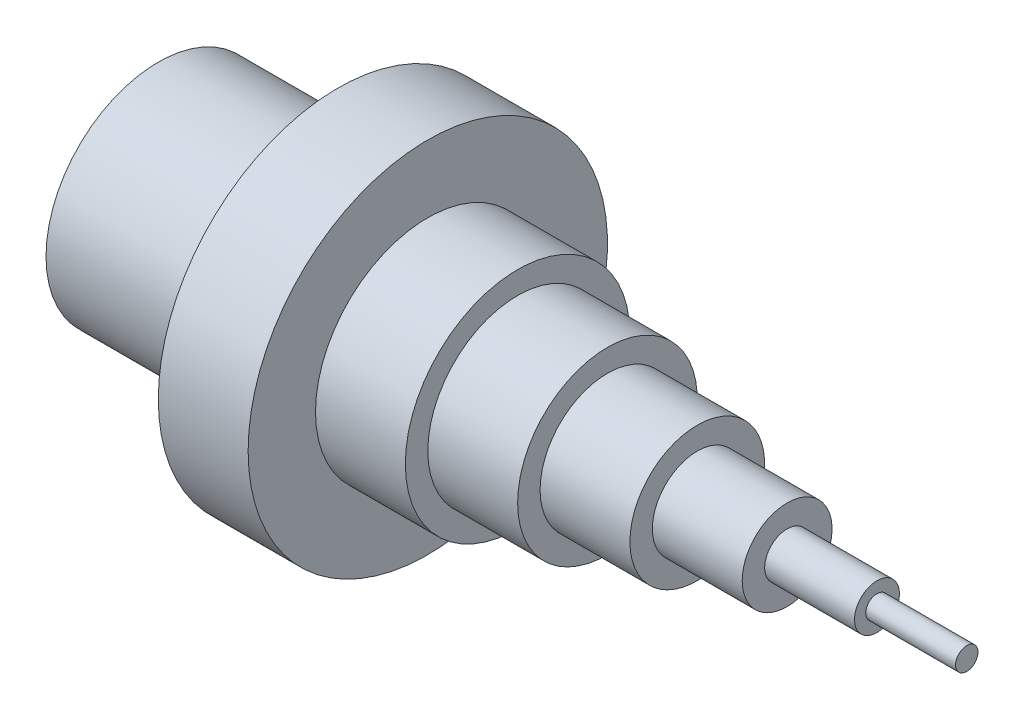
ISO-10303-21;
HEADER;
FILE_DESCRIPTION(('STEP AP214'),'2;1');
FILE_NAME('part.step','',(''),(''),'','','');
FILE_SCHEMA(('AUTOMOTIVE_DESIGN { 1 0 10303 214 1 1 1 1 }'));
ENDSEC;
DATA;
#1=APPLICATION_CONTEXT('core data for automotive mechanical design processes');
#2=APPLICATION_PROTOCOL_DEFINITION('international standard','automotive_design',2000,#1);
#3=PRODUCT_CONTEXT('',#1,'mechanical');
#4=PRODUCT('Part','Part','',(#3));
#5=PRODUCT_RELATED_PRODUCT_CATEGORY('part','',(#4));
#6=PRODUCT_DEFINITION_FORMATION('','',#4);
#7=PRODUCT_DEFINITION_CONTEXT('part definition',#1,'design');
#8=PRODUCT_DEFINITION('design','',#6,#7);
#9=PRODUCT_DEFINITION_SHAPE('','',#8);
#10=(LENGTH_UNIT() NAMED_UNIT(*) SI_UNIT(.MILLI.,.METRE.));
#11=(NAMED_UNIT(*) PLANE_ANGLE_UNIT() SI_UNIT($,.RADIAN.));
#12=(NAMED_UNIT(*) SI_UNIT($,.STERADIAN.) SOLID_ANGLE_UNIT());
#13=UNCERTAINTY_MEASURE_WITH_UNIT(LENGTH_MEASURE(1.E-05),#10,'distance_accuracy_value','');
#14=(GEOMETRIC_REPRESENTATION_CONTEXT(3) GLOBAL_UNCERTAINTY_ASSIGNED_CONTEXT((#13)) GLOBAL_UNIT_ASSIGNED_CONTEXT((#10,
#11,#12)) REPRESENTATION_CONTEXT('',''));
#15=CARTESIAN_POINT('',(0.,0.,0.));
#16=DIRECTION('',(0.,0.,1.));
#17=DIRECTION('',(1.,0.,0.));
#18=AXIS2_PLACEMENT_3D('',#15,#16,#17);
#19=CARTESIAN_POINT('',(0.,0.,0.));
#20=DIRECTION('',(1.,0.,0.));
#21=DIRECTION('',(0.,0.,-1.));
#22=AXIS2_PLACEMENT_3D('',#19,#20,#21);
#23=PLANE('',#22);
#24=CARTESIAN_POINT('',(0.,0.,0.));
#25=DIRECTION('',(-1.,0.,0.));
#26=DIRECTION('',(0.,0.,1.));
#27=AXIS2_PLACEMENT_3D('',#24,#25,#26);
#28=CIRCLE('',#27,20.);
#29=CARTESIAN_POINT('',(0.,0.,20.));
#30=VERTEX_POINT('',#29);
#31=EDGE_CURVE('E87',#30,#30,#28,.T.);
#32=ORIENTED_EDGE('',*,*,#31,.F.);
#33=EDGE_LOOP('',(#32));
#34=FACE_BOUND('',#33,.T.);
#35=CARTESIAN_POINT('',(0.,0.,0.));
#36=DIRECTION('',(-1.,0.,0.));
#37=DIRECTION('',(0.,0.,1.));
#38=AXIS2_PLACEMENT_3D('',#35,#36,#37);
#39=CIRCLE('',#38,25.);
#40=CARTESIAN_POINT('',(0.,0.,25.));
#41=VERTEX_POINT('',#40);
#42=EDGE_CURVE('E10',#41,#41,#39,.T.);
#43=ORIENTED_EDGE('',*,*,#42,.T.);
#44=EDGE_LOOP('',(#43));
#45=FACE_BOUND('',#44,.T.);
#46=ADVANCED_FACE('F31',(#34,#45),#23,.F.);
#47=CARTESIAN_POINT('',(0.,0.,0.));
#48=DIRECTION('',(-1.,0.,0.));
#49=DIRECTION('',(0.,0.,1.));
#50=AXIS2_PLACEMENT_3D('',#47,#48,#49);
#51=CYLINDRICAL_SURFACE('',#50,25.);
#52=ORIENTED_EDGE('',*,*,#42,.F.);
#53=EDGE_LOOP('',(#52));
#54=FACE_BOUND('',#53,.T.);
#55=CARTESIAN_POINT('',(40.,0.,0.));
#56=DIRECTION('',(-1.,0.,0.));
#57=DIRECTION('',(0.,0.,1.));
#58=AXIS2_PLACEMENT_3D('',#55,#56,#57);
#59=CIRCLE('',#58,25.);
#60=CARTESIAN_POINT('',(40.,0.,25.));
#61=VERTEX_POINT('',#60);
#62=EDGE_CURVE('E37',#61,#61,#59,.T.);
#63=ORIENTED_EDGE('',*,*,#62,.T.);
#64=EDGE_LOOP('',(#63));
#65=FACE_BOUND('',#64,.T.);
#66=ADVANCED_FACE('F103',(#54,#65),#51,.T.);
#67=CARTESIAN_POINT('',(40.,25.,0.));
#68=DIRECTION('',(1.,0.,0.));
#69=DIRECTION('',(0.,0.,-1.));
#70=AXIS2_PLACEMENT_3D('',#67,#68,#69);
#71=PLANE('',#70);
#72=ORIENTED_EDGE('',*,*,#62,.F.);
#73=EDGE_LOOP('',(#72));
#74=FACE_BOUND('',#73,.T.);
#75=CARTESIAN_POINT('',(40.,0.,0.));
#76=DIRECTION('',(-1.,0.,0.));
#77=DIRECTION('',(0.,0.,1.));
#78=AXIS2_PLACEMENT_3D('',#75,#76,#77);
#79=CIRCLE('',#78,40.);
#80=CARTESIAN_POINT('',(40.,0.,40.));
#81=VERTEX_POINT('',#80);
#82=EDGE_CURVE('E41',#81,#81,#79,.T.);
#83=ORIENTED_EDGE('',*,*,#82,.T.);
#84=EDGE_LOOP('',(#83));
#85=FACE_BOUND('',#84,.T.);
#86=ADVANCED_FACE('F107',(#74,#85),#71,.F.);
#87=CARTESIAN_POINT('',(0.,0.,0.));
#88=DIRECTION('',(-1.,0.,0.));
#89=DIRECTION('',(0.,0.,1.));
#90=AXIS2_PLACEMENT_3D('',#87,#88,#89);
#91=CYLINDRICAL_SURFACE('',#90,40.);
#92=ORIENTED_EDGE('',*,*,#82,.F.);
#93=EDGE_LOOP('',(#92));
#94=FACE_BOUND('',#93,.T.);
#95=CARTESIAN_POINT('',(60.,0.,0.));
#96=DIRECTION('',(-1.,0.,0.));
#97=DIRECTION('',(0.,0.,1.));
#98=AXIS2_PLACEMENT_3D('',#95,#96,#97);
#99=CIRCLE('',#98,40.);
#100=CARTESIAN_POINT('',(60.,0.,40.));
#101=VERTEX_POINT('',#100);
#102=EDGE_CURVE('E45',#101,#101,#99,.T.);
#103=ORIENTED_EDGE('',*,*,#102,.T.);
#104=EDGE_LOOP('',(#103));
#105=FACE_BOUND('',#104,.T.);
#106=ADVANCED_FACE('F112',(#94,#105),#91,.T.);
#107=CARTESIAN_POINT('',(60.,40.,0.));
#108=DIRECTION('',(-1.,0.,0.));
#109=DIRECTION('',(0.,0.,1.));
#110=AXIS2_PLACEMENT_3D('',#107,#108,#109);
#111=PLANE('',#110);
#112=ORIENTED_EDGE('',*,*,#102,.F.);
#113=EDGE_LOOP('',(#112));
#114=FACE_BOUND('',#113,.T.);
#115=CARTESIAN_POINT('',(60.,0.,0.));
#116=DIRECTION('',(-1.,0.,0.));
#117=DIRECTION('',(0.,0.,1.));
#118=AXIS2_PLACEMENT_3D('',#115,#116,#117);
#119=CIRCLE('',#118,25.);
#120=CARTESIAN_POINT('',(60.,0.,25.));
#121=VERTEX_POINT('',#120);
#122=EDGE_CURVE('E50',#121,#121,#119,.T.);
#123=ORIENTED_EDGE('',*,*,#122,.T.);
#124=EDGE_LOOP('',(#123));
#125=FACE_BOUND('',#124,.T.);
#126=ADVANCED_FACE('F118',(#114,#125),#111,.F.);
#127=CARTESIAN_POINT('',(0.,0.,0.));
#128=DIRECTION('',(-1.,0.,0.));
#129=DIRECTION('',(0.,0.,1.));
#130=AXIS2_PLACEMENT_3D('',#127,#128,#129);
#131=CYLINDRICAL_SURFACE('',#130,25.);
#132=ORIENTED_EDGE('',*,*,#122,.F.);
#133=EDGE_LOOP('',(#132));
#134=FACE_BOUND('',#133,.T.);
#135=CARTESIAN_POINT('',(80.,0.,0.));
#136=DIRECTION('',(-1.,0.,0.));
#137=DIRECTION('',(0.,0.,1.));
#138=AXIS2_PLACEMENT_3D('',#135,#136,#137);
#139=CIRCLE('',#138,25.);
#140=CARTESIAN_POINT('',(80.,0.,25.));
#141=VERTEX_POINT('',#140);
#142=EDGE_CURVE('E53',#141,#141,#139,.T.);
#143=ORIENTED_EDGE('',*,*,#142,.T.);
#144=EDGE_LOOP('',(#143));
#145=FACE_BOUND('',#144,.T.);
#146=ADVANCED_FACE('F122',(#134,#145),#131,.T.);
#147=CARTESIAN_POINT('',(80.,25.,0.));
#148=DIRECTION('',(-1.,0.,0.));
#149=DIRECTION('',(0.,0.,1.));
#150=AXIS2_PLACEMENT_3D('',#147,#148,#149);
#151=PLANE('',#150);
#152=ORIENTED_EDGE('',*,*,#142,.F.);
#153=EDGE_LOOP('',(#152));
#154=FACE_BOUND('',#153,.T.);
#155=CARTESIAN_POINT('',(80.,0.,0.));
#156=DIRECTION('',(-1.,0.,0.));
#157=DIRECTION('',(0.,0.,1.));
#158=AXIS2_PLACEMENT_3D('',#155,#156,#157);
#159=CIRCLE('',#158,20.);
#160=CARTESIAN_POINT('',(80.,0.,20.));
#161=VERTEX_POINT('',#160);
#162=EDGE_CURVE('E56',#161,#161,#159,.T.);
#163=ORIENTED_EDGE('',*,*,#162,.T.);
#164=EDGE_LOOP('',(#163));
#165=FACE_BOUND('',#164,.T.);
#166=ADVANCED_FACE('F126',(#154,#165),#151,.F.);
#167=CARTESIAN_POINT('',(0.,0.,0.));
#168=DIRECTION('',(-1.,0.,0.));
#169=DIRECTION('',(0.,0.,1.));
#170=AXIS2_PLACEMENT_3D('',#167,#168,#169);
#171=CYLINDRICAL_SURFACE('',#170,20.);
#172=ORIENTED_EDGE('',*,*,#162,.F.);
#173=EDGE_LOOP('',(#172));
#174=FACE_BOUND('',#173,.T.);
#175=CARTESIAN_POINT('',(100.,0.,0.));
#176=DIRECTION('',(-1.,0.,0.));
#177=DIRECTION('',(0.,0.,1.));
#178=AXIS2_PLACEMENT_3D('',#175,#176,#177);
#179=CIRCLE('',#178,20.);
#180=CARTESIAN_POINT('',(100.,0.,20.));
#181=VERTEX_POINT('',#180);
#182=EDGE_CURVE('E59',#181,#181,#179,.T.);
#183=ORIENTED_EDGE('',*,*,#182,.T.);
#184=EDGE_LOOP('',(#183));
#185=FACE_BOUND('',#184,.T.);
#186=ADVANCED_FACE('F130',(#174,#185),#171,.T.);
#187=CARTESIAN_POINT('',(100.,20.,0.));
#188=DIRECTION('',(-1.,0.,0.));
#189=DIRECTION('',(0.,0.,1.));
#190=AXIS2_PLACEMENT_3D('',#187,#188,#189);
#191=PLANE('',#190);
#192=ORIENTED_EDGE('',*,*,#182,.F.);
#193=EDGE_LOOP('',(#192));
#194=FACE_BOUND('',#193,.T.);
#195=CARTESIAN_POINT('',(100.,0.,0.));
#196=DIRECTION('',(-1.,0.,0.));
#197=DIRECTION('',(0.,0.,1.));
#198=AXIS2_PLACEMENT_3D('',#195,#196,#197);
#199=CIRCLE('',#198,15.);
#200=CARTESIAN_POINT('',(100.,0.,15.));
#201=VERTEX_POINT('',#200);
#202=EDGE_CURVE('E62',#201,#201,#199,.T.);
#203=ORIENTED_EDGE('',*,*,#202,.T.);
#204=EDGE_LOOP('',(#203));
#205=FACE_BOUND('',#204,.T.);
#206=ADVANCED_FACE('F134',(#194,#205),#191,.F.);
#207=CARTESIAN_POINT('',(0.,0.,0.));
#208=DIRECTION('',(-1.,0.,0.));
#209=DIRECTION('',(0.,0.,1.));
#210=AXIS2_PLACEMENT_3D('',#207,#208,#209);
#211=CYLINDRICAL_SURFACE('',#210,15.);
#212=ORIENTED_EDGE('',*,*,#202,.F.);
#213=EDGE_LOOP('',(#212));
#214=FACE_BOUND('',#213,.T.);
#215=CARTESIAN_POINT('',(120.,0.,0.));
#216=DIRECTION('',(-1.,0.,0.));
#217=DIRECTION('',(0.,0.,1.));
#218=AXIS2_PLACEMENT_3D('',#215,#216,#217);
#219=CIRCLE('',#218,15.);
#220=CARTESIAN_POINT('',(120.,0.,15.));
#221=VERTEX_POINT('',#220);
#222=EDGE_CURVE('E65',#221,#221,#219,.T.);
#223=ORIENTED_EDGE('',*,*,#222,.T.);
#224=EDGE_LOOP('',(#223));
#225=FACE_BOUND('',#224,.T.);
#226=ADVANCED_FACE('F138',(#214,#225),#211,.T.);
#227=CARTESIAN_POINT('',(120.,15.,0.));
#228=DIRECTION('',(-1.,0.,0.));
#229=DIRECTION('',(0.,0.,1.));
#230=AXIS2_PLACEMENT_3D('',#227,#228,#229);
#231=PLANE('',#230);
#232=ORIENTED_EDGE('',*,*,#222,.F.);
#233=EDGE_LOOP('',(#232));
#234=FACE_BOUND('',#233,.T.);
#235=CARTESIAN_POINT('',(120.,0.,0.));
#236=DIRECTION('',(-1.,0.,0.));
#237=DIRECTION('',(0.,0.,1.));
#238=AXIS2_PLACEMENT_3D('',#235,#236,#237);
#239=CIRCLE('',#238,10.);
#240=CARTESIAN_POINT('',(120.,0.,10.));
#241=VERTEX_POINT('',#240);
#242=EDGE_CURVE('E68',#241,#241,#239,.T.);
#243=ORIENTED_EDGE('',*,*,#242,.T.);
#244=EDGE_LOOP('',(#243));
#245=FACE_BOUND('',#244,.T.);
#246=ADVANCED_FACE('F142',(#234,#245),#231,.F.);
#247=CARTESIAN_POINT('',(0.,0.,0.));
#248=DIRECTION('',(-1.,0.,0.));
#249=DIRECTION('',(0.,0.,1.));
#250=AXIS2_PLACEMENT_3D('',#247,#248,#249);
#251=CYLINDRICAL_SURFACE('',#250,10.);
#252=ORIENTED_EDGE('',*,*,#242,.F.);
#253=EDGE_LOOP('',(#252));
#254=FACE_BOUND('',#253,.T.);
#255=CARTESIAN_POINT('',(140.,0.,0.));
#256=DIRECTION('',(-1.,0.,0.));
#257=DIRECTION('',(0.,0.,1.));
#258=AXIS2_PLACEMENT_3D('',#255,#256,#257);
#259=CIRCLE('',#258,10.);
#260=CARTESIAN_POINT('',(140.,0.,10.));
#261=VERTEX_POINT('',#260);
#262=EDGE_CURVE('E71',#261,#261,#259,.T.);
#263=ORIENTED_EDGE('',*,*,#262,.T.);
#264=EDGE_LOOP('',(#263));
#265=FACE_BOUND('',#264,.T.);
#266=ADVANCED_FACE('F146',(#254,#265),#251,.T.);
#267=CARTESIAN_POINT('',(140.,10.,0.));
#268=DIRECTION('',(-1.,0.,0.));
#269=DIRECTION('',(0.,0.,1.));
#270=AXIS2_PLACEMENT_3D('',#267,#268,#269);
#271=PLANE('',#270);
#272=ORIENTED_EDGE('',*,*,#262,.F.);
#273=EDGE_LOOP('',(#272));
#274=FACE_BOUND('',#273,.T.);
#275=CARTESIAN_POINT('',(140.,0.,0.));
#276=DIRECTION('',(-1.,0.,0.));
#277=DIRECTION('',(0.,0.,1.));
#278=AXIS2_PLACEMENT_3D('',#275,#276,#277);
#279=CIRCLE('',#278,5.);
#280=CARTESIAN_POINT('',(140.,0.,5.));
#281=VERTEX_POINT('',#280);
#282=EDGE_CURVE('E74',#281,#281,#279,.T.);
#283=ORIENTED_EDGE('',*,*,#282,.T.);
#284=EDGE_LOOP('',(#283));
#285=FACE_BOUND('',#284,.T.);
#286=ADVANCED_FACE('F150',(#274,#285),#271,.F.);
#287=CARTESIAN_POINT('',(0.,0.,0.));
#288=DIRECTION('',(-1.,0.,0.));
#289=DIRECTION('',(0.,0.,1.));
#290=AXIS2_PLACEMENT_3D('',#287,#288,#289);
#291=CYLINDRICAL_SURFACE('',#290,5.);
#292=ORIENTED_EDGE('',*,*,#282,.F.);
#293=EDGE_LOOP('',(#292));
#294=FACE_BOUND('',#293,.T.);
#295=CARTESIAN_POINT('',(160.,0.,0.));
#296=DIRECTION('',(-1.,0.,0.));
#297=DIRECTION('',(0.,0.,1.));
#298=AXIS2_PLACEMENT_3D('',#295,#296,#297);
#299=CIRCLE('',#298,5.);
#300=CARTESIAN_POINT('',(160.,0.,5.));
#301=VERTEX_POINT('',#300);
#302=EDGE_CURVE('E77',#301,#301,#299,.T.);
#303=ORIENTED_EDGE('',*,*,#302,.T.);
#304=EDGE_LOOP('',(#303));
#305=FACE_BOUND('',#304,.T.);
#306=ADVANCED_FACE('F154',(#294,#305),#291,.T.);
#307=CARTESIAN_POINT('',(160.,5.,0.));
#308=DIRECTION('',(-1.,0.,0.));
#309=DIRECTION('',(0.,0.,1.));
#310=AXIS2_PLACEMENT_3D('',#307,#308,#309);
#311=PLANE('',#310);
#312=ORIENTED_EDGE('',*,*,#302,.F.);
#313=EDGE_LOOP('',(#312));
#314=FACE_BOUND('',#313,.T.);
#315=CARTESIAN_POINT('',(160.,0.,0.));
#316=DIRECTION('',(-1.,0.,0.));
#317=DIRECTION('',(0.,0.,1.));
#318=AXIS2_PLACEMENT_3D('',#315,#316,#317);
#319=CIRCLE('',#318,2.5);
#320=CARTESIAN_POINT('',(160.,0.,2.5));
#321=VERTEX_POINT('',#320);
#322=EDGE_CURVE('E80',#321,#321,#319,.T.);
#323=ORIENTED_EDGE('',*,*,#322,.T.);
#324=EDGE_LOOP('',(#323));
#325=FACE_BOUND('',#324,.T.);
#326=ADVANCED_FACE('F158',(#314,#325),#311,.F.);
#327=CARTESIAN_POINT('',(0.,0.,0.));
#328=DIRECTION('',(-1.,0.,0.));
#329=DIRECTION('',(0.,0.,1.));
#330=AXIS2_PLACEMENT_3D('',#327,#328,#329);
#331=CYLINDRICAL_SURFACE('',#330,2.5);
#332=ORIENTED_EDGE('',*,*,#322,.F.);
#333=EDGE_LOOP('',(#332));
#334=FACE_BOUND('',#333,.T.);
#335=CARTESIAN_POINT('',(180.,0.,0.));
#336=DIRECTION('',(-1.,0.,0.));
#337=DIRECTION('',(0.,0.,1.));
#338=AXIS2_PLACEMENT_3D('',#335,#336,#337);
#339=CIRCLE('',#338,2.5);
#340=CARTESIAN_POINT('',(180.,0.,2.5));
#341=VERTEX_POINT('',#340);
#342=EDGE_CURVE('E83',#341,#341,#339,.T.);
#343=ORIENTED_EDGE('',*,*,#342,.T.);
#344=EDGE_LOOP('',(#343));
#345=FACE_BOUND('',#344,.T.);
#346=ADVANCED_FACE('F162',(#334,#345),#331,.T.);
#347=CARTESIAN_POINT('',(180.,2.5,0.));
#348=DIRECTION('',(-1.,0.,0.));
#349=DIRECTION('',(0.,0.,1.));
#350=AXIS2_PLACEMENT_3D('',#347,#348,#349);
#351=PLANE('',#350);
#352=ORIENTED_EDGE('',*,*,#342,.F.);
#353=EDGE_LOOP('',(#352));
#354=FACE_BOUND('',#353,.T.);
#355=ADVANCED_FACE('F98',(#354),#351,.F.);
#356=CARTESIAN_POINT('',(40.,0.,0.));
#357=DIRECTION('',(-1.,0.,0.));
#358=DIRECTION('',(0.,0.,1.));
#359=AXIS2_PLACEMENT_3D('',#356,#357,#358);
#360=CYLINDRICAL_SURFACE('',#359,20.);
#361=CARTESIAN_POINT('',(40.,0.,0.));
#362=DIRECTION('',(-1.,0.,0.));
#363=DIRECTION('',(0.,0.,1.));
#364=AXIS2_PLACEMENT_3D('',#361,#362,#363);
#365=CIRCLE('',#364,20.);
#366=CARTESIAN_POINT('',(40.,0.,20.));
#367=VERTEX_POINT('',#366);
#368=EDGE_CURVE('E86',#367,#367,#365,.T.);
#369=ORIENTED_EDGE('',*,*,#368,.F.);
#370=EDGE_LOOP('',(#369));
#371=FACE_BOUND('',#370,.T.);
#372=ORIENTED_EDGE('',*,*,#31,.T.);
#373=EDGE_LOOP('',(#372));
#374=FACE_BOUND('',#373,.T.);
#375=ADVANCED_FACE('F95',(#371,#374),#360,.F.);
#376=CARTESIAN_POINT('',(40.,0.,0.));
#377=DIRECTION('',(-1.,0.,0.));
#378=DIRECTION('',(0.,0.,1.));
#379=AXIS2_PLACEMENT_3D('',#376,#377,#378);
#380=PLANE('',#379);
#381=ORIENTED_EDGE('',*,*,#368,.T.);
#382=EDGE_LOOP('',(#381));
#383=FACE_BOUND('',#382,.T.);
#384=ADVANCED_FACE('F93',(#383),#380,.T.);
#385=CLOSED_SHELL('',(#46,#66,#86,#106,#126,#146,#166,#186,#206,#226,#246,#266,#286,#306,#326,
#346,#355,#375,#384));
#386=MANIFOLD_SOLID_BREP('B2',#385);
#387=ADVANCED_BREP_SHAPE_REPRESENTATION('',(#18,#386),#14);
#388=SHAPE_DEFINITION_REPRESENTATION(#9,#387);
ENDSEC;
END-ISO-10303-21;
